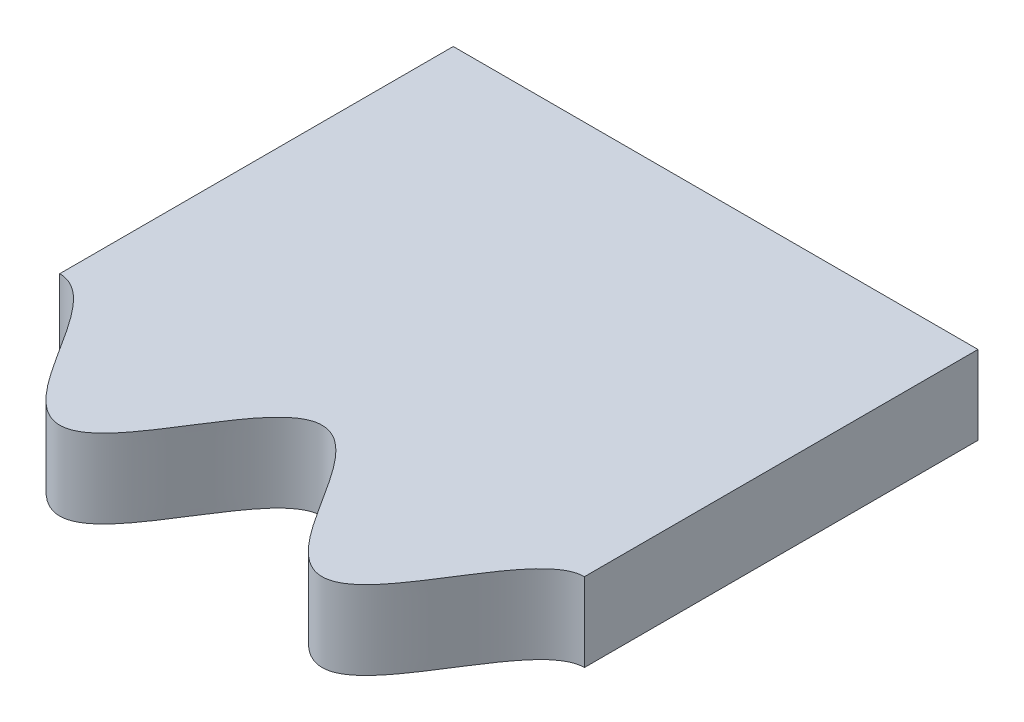
ISO-10303-21;
HEADER;
FILE_DESCRIPTION(('STEP AP214'),'2;1');
FILE_NAME('part.step','',(''),(''),'','','');
FILE_SCHEMA(('AUTOMOTIVE_DESIGN { 1 0 10303 214 1 1 1 1 }'));
ENDSEC;
DATA;
#1=APPLICATION_CONTEXT('core data for automotive mechanical design processes');
#2=APPLICATION_PROTOCOL_DEFINITION('international standard','automotive_design',2000,#1);
#3=PRODUCT_CONTEXT('',#1,'mechanical');
#4=PRODUCT('Part','Part','',(#3));
#5=PRODUCT_RELATED_PRODUCT_CATEGORY('part','',(#4));
#6=PRODUCT_DEFINITION_FORMATION('','',#4);
#7=PRODUCT_DEFINITION_CONTEXT('part definition',#1,'design');
#8=PRODUCT_DEFINITION('design','',#6,#7);
#9=PRODUCT_DEFINITION_SHAPE('','',#8);
#10=(LENGTH_UNIT() NAMED_UNIT(*) SI_UNIT(.MILLI.,.METRE.));
#11=(NAMED_UNIT(*) PLANE_ANGLE_UNIT() SI_UNIT($,.RADIAN.));
#12=(NAMED_UNIT(*) SI_UNIT($,.STERADIAN.) SOLID_ANGLE_UNIT());
#13=UNCERTAINTY_MEASURE_WITH_UNIT(LENGTH_MEASURE(1.E-05),#10,'distance_accuracy_value','');
#14=(GEOMETRIC_REPRESENTATION_CONTEXT(3) GLOBAL_UNCERTAINTY_ASSIGNED_CONTEXT((#13)) GLOBAL_UNIT_ASSIGNED_CONTEXT((#10,
#11,#12)) REPRESENTATION_CONTEXT('',''));
#15=CARTESIAN_POINT('',(0.,0.,0.));
#16=DIRECTION('',(0.,0.,1.));
#17=DIRECTION('',(1.,0.,0.));
#18=AXIS2_PLACEMENT_3D('',#15,#16,#17);
#19=CARTESIAN_POINT('',(10.,3.,10.));
#20=DIRECTION('',(-1.,0.,0.));
#21=DIRECTION('',(0.,0.,1.));
#22=AXIS2_PLACEMENT_3D('',#19,#20,#21);
#23=PLANE('',#22);
#24=DIRECTION('',(0.,1.,0.));
#25=VECTOR('',#24,1.);
#26=CARTESIAN_POINT('',(10.,0.,5.));
#27=LINE('',#26,#25);
#28=CARTESIAN_POINT('',(10.,0.,5.));
#29=VERTEX_POINT('',#28);
#30=CARTESIAN_POINT('',(10.0000000003445,3.,5.));
#31=VERTEX_POINT('',#30);
#32=EDGE_CURVE('E65',#29,#31,#27,.T.);
#33=ORIENTED_EDGE('',*,*,#32,.F.);
#34=DIRECTION('',(0.,0.,-1.));
#35=VECTOR('',#34,1.);
#36=CARTESIAN_POINT('',(10.,0.,10.));
#37=LINE('',#36,#35);
#38=CARTESIAN_POINT('',(10.,0.,-10.));
#39=VERTEX_POINT('',#38);
#40=EDGE_CURVE('E89',#29,#39,#37,.T.);
#41=ORIENTED_EDGE('',*,*,#40,.T.);
#42=DIRECTION('',(0.,-1.,0.));
#43=VECTOR('',#42,1.);
#44=CARTESIAN_POINT('',(10.,3.,-10.));
#45=LINE('',#44,#43);
#46=CARTESIAN_POINT('',(10.,3.,-10.));
#47=VERTEX_POINT('',#46);
#48=EDGE_CURVE('E11',#47,#39,#45,.T.);
#49=ORIENTED_EDGE('',*,*,#48,.F.);
#50=DIRECTION('',(0.,0.,-1.));
#51=VECTOR('',#50,1.);
#52=CARTESIAN_POINT('',(10.,3.,10.));
#53=LINE('',#52,#51);
#54=EDGE_CURVE('E74',#31,#47,#53,.T.);
#55=ORIENTED_EDGE('',*,*,#54,.F.);
#56=EDGE_LOOP('',(#33,#41,#49,#55));
#57=FACE_BOUND('',#56,.T.);
#58=ADVANCED_FACE('F33',(#57),#23,.F.);
#59=CARTESIAN_POINT('',(-10.,3.,10.));
#60=DIRECTION('',(1.,0.,0.));
#61=DIRECTION('',(0.,0.,-1.));
#62=AXIS2_PLACEMENT_3D('',#59,#60,#61);
#63=PLANE('',#62);
#64=DIRECTION('',(0.,1.,0.));
#65=VECTOR('',#64,1.);
#66=CARTESIAN_POINT('',(-10.,0.,5.));
#67=LINE('',#66,#65);
#68=CARTESIAN_POINT('',(-10.,0.,5.));
#69=VERTEX_POINT('',#68);
#70=CARTESIAN_POINT('',(-9.99999999965552,3.,5.));
#71=VERTEX_POINT('',#70);
#72=EDGE_CURVE('E52',#69,#71,#67,.T.);
#73=ORIENTED_EDGE('',*,*,#72,.T.);
#74=DIRECTION('',(0.,0.,1.));
#75=VECTOR('',#74,1.);
#76=CARTESIAN_POINT('',(-10.,3.,10.));
#77=LINE('',#76,#75);
#78=CARTESIAN_POINT('',(-10.,3.,-10.));
#79=VERTEX_POINT('',#78);
#80=EDGE_CURVE('E95',#79,#71,#77,.T.);
#81=ORIENTED_EDGE('',*,*,#80,.F.);
#82=DIRECTION('',(0.,-1.,0.));
#83=VECTOR('',#82,1.);
#84=CARTESIAN_POINT('',(-10.,3.,-10.));
#85=LINE('',#84,#83);
#86=CARTESIAN_POINT('',(-10.,0.,-10.));
#87=VERTEX_POINT('',#86);
#88=EDGE_CURVE('E44',#79,#87,#85,.T.);
#89=ORIENTED_EDGE('',*,*,#88,.T.);
#90=DIRECTION('',(0.,0.,1.));
#91=VECTOR('',#90,1.);
#92=CARTESIAN_POINT('',(-10.,0.,10.));
#93=LINE('',#92,#91);
#94=EDGE_CURVE('E88',#87,#69,#93,.T.);
#95=ORIENTED_EDGE('',*,*,#94,.T.);
#96=EDGE_LOOP('',(#73,#81,#89,#95));
#97=FACE_BOUND('',#96,.T.);
#98=ADVANCED_FACE('F93',(#97),#63,.F.);
#99=CARTESIAN_POINT('',(0.,3.,0.));
#100=DIRECTION('',(0.,-1.,0.));
#101=DIRECTION('',(0.,0.,-1.));
#102=AXIS2_PLACEMENT_3D('',#99,#100,#101);
#103=PLANE('',#102);
#104=CARTESIAN_POINT('',(-9.99999999931104,3.,5.));
#105=CARTESIAN_POINT('',(-9.99082001437918,3.,5.));
#106=CARTESIAN_POINT('',(-9.97244635755843,3.,5.00031258280608));
#107=CARTESIAN_POINT('',(-9.93938747114682,3.,5.0017192065243));
#108=CARTESIAN_POINT('',(-9.89196951877511,3.,5.00545484638884));
#109=CARTESIAN_POINT('',(-9.83592223774,3.,5.01241231200123));
#110=CARTESIAN_POINT('',(-9.77303376701536,3.,5.0243360940524));
#111=CARTESIAN_POINT('',(-9.69889854113709,3.,5.04321948192614));
#112=CARTESIAN_POINT('',(-9.61604277433707,3.,5.07104387662175));
#113=CARTESIAN_POINT('',(-9.51539692492575,3.,5.11282490925097));
#114=CARTESIAN_POINT('',(-9.38733060556712,3.,5.17887883126997));
#115=CARTESIAN_POINT('',(-9.23713055985856,3.,5.27635471018832));
#116=CARTESIAN_POINT('',(-9.06996834134291,3.,5.40982332741547));
#117=CARTESIAN_POINT('',(-8.90457564809527,3.,5.56508434026283));
#118=CARTESIAN_POINT('',(-8.7489612287523,3.,5.73006325874342));
#119=CARTESIAN_POINT('',(-8.60130778536925,3.,5.90213684094534));
#120=CARTESIAN_POINT('',(-8.46007700944654,3.,6.07949551678153));
#121=CARTESIAN_POINT('',(-8.32404000169283,3.,6.26084497150106));
#122=CARTESIAN_POINT('',(-8.18265527581067,3.,6.45853429864135));
#123=CARTESIAN_POINT('',(-8.03590703117052,3.,6.67241814731907));
#124=CARTESIAN_POINT('',(-7.88348141853783,3.,6.90219128809631));
#125=CARTESIAN_POINT('',(-7.72477345486102,3.,7.14737774531498));
#126=CARTESIAN_POINT('',(-7.52835049489709,3.,7.45513225242725));
#127=CARTESIAN_POINT('',(-7.2935706466482,3.,7.8250015959));
#128=CARTESIAN_POINT('',(-7.03464620121291,3.,8.2260611788318));
#129=CARTESIAN_POINT('',(-6.74300148875256,3.,8.65253335255465));
#130=CARTESIAN_POINT('',(-6.45275627161435,3.,9.0386496761071));
#131=CARTESIAN_POINT('',(-6.15977928798915,3.,9.37945193691896));
#132=CARTESIAN_POINT('',(-5.85167297950494,3.,9.66936159789187));
#133=CARTESIAN_POINT('',(-5.52099911676154,3.,9.88951274625956));
#134=CARTESIAN_POINT('',(-5.16718469959597,3.,10.0107796048101));
#135=CARTESIAN_POINT('',(-4.81669827132216,3.,10.0082047149901));
#136=CARTESIAN_POINT('',(-4.46319800184277,3.,9.88148028990629));
#137=CARTESIAN_POINT('',(-4.13245941221351,3.,9.65630351845059));
#138=CARTESIAN_POINT('',(-3.82518617782554,3.,9.36337460129456));
#139=CARTESIAN_POINT('',(-3.53356604995753,3.,9.02140752316623));
#140=CARTESIAN_POINT('',(-3.24460958171085,3.,8.63501856258895));
#141=CARTESIAN_POINT('',(-2.95419813160473,3.,8.20909034918839));
#142=CARTESIAN_POINT('',(-2.65686698526825,3.,7.74795426612715));
#143=CARTESIAN_POINT('',(-2.34581471696202,3.,7.25627199583769));
#144=CARTESIAN_POINT('',(-2.04855364815221,3.,6.79509133401284));
#145=CARTESIAN_POINT('',(-1.75827897641475,3.,6.36907074495268));
#146=CARTESIAN_POINT('',(-1.46954105510516,3.,5.98252143809928));
#147=CARTESIAN_POINT('',(-1.17822395531635,3.,5.64030017025521));
#148=CARTESIAN_POINT('',(-0.871397135841551,3.,5.34692679658111));
#149=CARTESIAN_POINT('',(-0.541242946949233,3.,5.12094954109834));
#150=CARTESIAN_POINT('',(-0.188339321343954,3.,4.99278354485659));
#151=CARTESIAN_POINT('',(0.162127550098853,3.,4.98833930062318));
#152=CARTESIAN_POINT('',(0.516516058955745,3.,5.10812379820319));
#153=CARTESIAN_POINT('',(0.847789499972692,3.,5.32744136166359));
#154=CARTESIAN_POINT('',(1.15633761061201,3.,5.6169010175441));
#155=CARTESIAN_POINT('',(1.44964940090906,3.,5.95742231082353));
#156=CARTESIAN_POINT('',(1.74008086012842,3.,6.34340524055233));
#157=CARTESIAN_POINT('',(2.03192959783582,3.,6.76972875296932));
#158=CARTESIAN_POINT('',(2.40964594109057,3.,7.35487850542105));
#159=CARTESIAN_POINT('',(2.78090922982973,3.,7.94523233006462));
#160=CARTESIAN_POINT('',(3.14574990729865,3.,8.50129399252891));
#161=CARTESIAN_POINT('',(3.52329318896242,3.,9.00864727130667));
#162=CARTESIAN_POINT('',(3.81685925310001,3.,9.35461538527141));
#163=CARTESIAN_POINT('',(4.12602543551394,3.,9.65125911623179));
#164=CARTESIAN_POINT('',(4.4589635091427,3.,9.87955606813572));
#165=CARTESIAN_POINT('',(4.81453515306973,3.,10.0080970607132));
#166=CARTESIAN_POINT('',(5.16651906223438,3.,10.0110153151384));
#167=CARTESIAN_POINT('',(5.52099605302878,3.,9.8895087562826));
#168=CARTESIAN_POINT('',(5.8516752952148,3.,9.6693644201522));
#169=CARTESIAN_POINT('',(6.15977743094213,3.,9.37944993871306));
#170=CARTESIAN_POINT('',(6.45275759757276,3.,9.03865066000419));
#171=CARTESIAN_POINT('',(6.7430002688316,3.,8.65253306261331));
#172=CARTESIAN_POINT('',(7.03464770147423,3.,8.2260608059929));
#173=CARTESIAN_POINT('',(7.33317530977178,3.,7.76365385774044));
#174=CARTESIAN_POINT('',(7.60642338358273,3.,7.3317214480071));
#175=CARTESIAN_POINT('',(7.84311922279969,3.,6.96303763204388));
#176=CARTESIAN_POINT('',(8.03590493109137,3.,6.67241958663214));
#177=CARTESIAN_POINT('',(8.18265718418306,3.,6.45853340349873));
#178=CARTESIAN_POINT('',(8.32403784221397,3.,6.26084548509797));
#179=CARTESIAN_POINT('',(8.46008017960912,3.,6.0794952510917));
#180=CARTESIAN_POINT('',(8.60130281900421,3.,5.90213690838074));
#181=CARTESIAN_POINT('',(8.74896919321557,3.,5.73006337300852));
#182=CARTESIAN_POINT('',(8.90456309324699,3.,5.56508402919109));
#183=CARTESIAN_POINT('',(9.06998641092107,3.,5.40982383276834));
#184=CARTESIAN_POINT('',(9.23710257708555,3.,5.2763538880521));
#185=CARTESIAN_POINT('',(9.40569368871927,3.,5.16699305416285));
#186=CARTESIAN_POINT('',(9.55451652275392,3.,5.09347750486071));
#187=CARTESIAN_POINT('',(9.67766268892188,3.,5.04861308650827));
#188=CARTESIAN_POINT('',(9.7730485325158,3.,5.02433654212541));
#189=CARTESIAN_POINT('',(9.83592168274235,3.,5.01241229509332));
#190=CARTESIAN_POINT('',(9.89196848201379,3.,5.00545481487434));
#191=CARTESIAN_POINT('',(9.93938704672832,3.,5.00171919360456));
#192=CARTESIAN_POINT('',(9.97244631431849,3.,5.00031258145348));
#193=CARTESIAN_POINT('',(9.99082001575711,3.,5.));
#194=CARTESIAN_POINT('',(10.000000000689,3.,5.));
#195=B_SPLINE_CURVE_WITH_KNOTS('',4,(#104,#105,#106,#107,#108,#109,#110,#111,#112,#113,#114,
#115,#116,#117,#118,#119,#120,#121,#122,#123,#124,#125,#126,#127,#128,#129,#130,#131,#132,#133,
#134,#135,#136,#137,#138,#139,#140,#141,#142,#143,#144,#145,#146,#147,#148,#149,#150,#151,#152,
#153,#154,#155,#156,#157,#158,#159,#160,#161,#162,#163,#164,#165,#166,#167,#168,#169,#170,#171,
#172,#173,#174,#175,#176,#177,#178,#179,#180,#181,#182,#183,#184,#185,#186,#187,#188,#189,#190,
#191,#192,#193,#194),.UNSPECIFIED.,.F.,.F.,(5,1,1,1,1,1,1,1,1,1,1,1,1,1,1,1,1,1,1,1,1,1,1,1,1,1,
1,1,1,1,1,1,1,1,1,1,1,1,1,1,1,1,1,1,1,1,1,1,1,1,1,1,1,1,1,1,1,1,1,1,1,1,1,1,1,1,1,1,1,1,1,1,1,1,
1,1,1,1,1,1,1,1,1,1,1,1,1,5),(0.0788154969069754,0.0800698558664366,0.0813242147984401,
0.0825785737304436,0.0838329326624472,0.0863416505264542,0.0888503683904613,0.0913590862544684,
0.0938678041184755,0.0988852398464896,0.105408028363832,0.111930816881175,0.118453605398517,
0.12497639391586,0.131499182433202,0.138021970950545,0.144544759467888,0.15106754798523,
0.159472005704982,0.167876463424733,0.176280921144484,0.184685378864236,0.201494294303738,
0.218303209743241,0.231223727279946,0.24414424481665,0.257064762353355,0.26998527989006,
0.27976852467509,0.28955176946012,0.299506241208716,0.309460712957312,0.322382190403877,
0.335303667850441,0.348225145297005,0.361146622743569,0.377889240891207,0.394631859038846,
0.411374477186485,0.428117095334123,0.441038583364772,0.45396007139542,0.466881559426069,
0.479803047456718,0.489757500982272,0.499711954507825,0.509495207864302,0.519278461220779,
0.532198991532702,0.545119521844626,0.55804005215655,0.570960582468474,0.587769475723957,
0.60457836897944,0.638196155490407,0.65124175130361,0.664287347116814,0.677332942930017,
0.690378538743221,0.700413384641552,0.710448230539883,0.720231475324913,0.730014720109944,
0.742935237646649,0.755855755183354,0.768776272720059,0.781696790256764,0.798505705696267,
0.815314621135769,0.832123536575272,0.840527994295023,0.848932452014775,0.855455240532117,
0.861978029049459,0.868500817566802,0.875023606084144,0.881546394601487,0.888069183118829,
0.894591971636172,0.901114760153514,0.906132195881528,0.911149631609542,0.913658349473549,
0.916167067337556,0.91742142626956,0.918675785201563,0.919930144133567,0.921184503042035),.UNSPECIFIED.);
#196=EDGE_CURVE('E36',#71,#31,#195,.T.);
#197=ORIENTED_EDGE('',*,*,#196,.T.);
#198=ORIENTED_EDGE('',*,*,#54,.T.);
#199=DIRECTION('',(-1.,0.,0.));
#200=VECTOR('',#199,1.);
#201=CARTESIAN_POINT('',(-10.,3.,-10.));
#202=LINE('',#201,#200);
#203=EDGE_CURVE('E99',#47,#79,#202,.T.);
#204=ORIENTED_EDGE('',*,*,#203,.T.);
#205=ORIENTED_EDGE('',*,*,#80,.T.);
#206=EDGE_LOOP('',(#197,#198,#204,#205));
#207=FACE_BOUND('',#206,.T.);
#208=ADVANCED_FACE('F117',(#207),#103,.F.);
#209=CARTESIAN_POINT('',(0.,0.,0.));
#210=DIRECTION('',(0.,-1.,0.));
#211=DIRECTION('',(0.,0.,-1.));
#212=AXIS2_PLACEMENT_3D('',#209,#210,#211);
#213=PLANE('',#212);
#214=ORIENTED_EDGE('',*,*,#40,.F.);
#215=CARTESIAN_POINT('',(-9.99999999931104,0.,5.));
#216=CARTESIAN_POINT('',(-9.99082001437918,0.,5.));
#217=CARTESIAN_POINT('',(-9.97244635755843,0.,5.00031258280608));
#218=CARTESIAN_POINT('',(-9.93938747114682,0.,5.0017192065243));
#219=CARTESIAN_POINT('',(-9.89196951877511,0.,5.00545484638884));
#220=CARTESIAN_POINT('',(-9.83592223774,0.,5.01241231200123));
#221=CARTESIAN_POINT('',(-9.77303376701536,0.,5.0243360940524));
#222=CARTESIAN_POINT('',(-9.69889854113709,0.,5.04321948192614));
#223=CARTESIAN_POINT('',(-9.61604277433707,0.,5.07104387662175));
#224=CARTESIAN_POINT('',(-9.51539692492575,0.,5.11282490925097));
#225=CARTESIAN_POINT('',(-9.38733060556712,0.,5.17887883126997));
#226=CARTESIAN_POINT('',(-9.23713055985856,0.,5.27635471018832));
#227=CARTESIAN_POINT('',(-9.06996834134291,0.,5.40982332741547));
#228=CARTESIAN_POINT('',(-8.90457564809527,0.,5.56508434026283));
#229=CARTESIAN_POINT('',(-8.7489612287523,0.,5.73006325874342));
#230=CARTESIAN_POINT('',(-8.60130778536925,0.,5.90213684094534));
#231=CARTESIAN_POINT('',(-8.46007700944654,0.,6.07949551678153));
#232=CARTESIAN_POINT('',(-8.32404000169283,0.,6.26084497150106));
#233=CARTESIAN_POINT('',(-8.18265527581067,0.,6.45853429864135));
#234=CARTESIAN_POINT('',(-8.03590703117052,0.,6.67241814731907));
#235=CARTESIAN_POINT('',(-7.88348141853783,0.,6.90219128809631));
#236=CARTESIAN_POINT('',(-7.72477345486102,0.,7.14737774531498));
#237=CARTESIAN_POINT('',(-7.52835049489709,0.,7.45513225242725));
#238=CARTESIAN_POINT('',(-7.2935706466482,0.,7.8250015959));
#239=CARTESIAN_POINT('',(-7.03464620121291,0.,8.2260611788318));
#240=CARTESIAN_POINT('',(-6.74300148875256,0.,8.65253335255465));
#241=CARTESIAN_POINT('',(-6.45275627161435,0.,9.0386496761071));
#242=CARTESIAN_POINT('',(-6.15977928798915,0.,9.37945193691896));
#243=CARTESIAN_POINT('',(-5.85167297950494,0.,9.66936159789187));
#244=CARTESIAN_POINT('',(-5.52099911676154,0.,9.88951274625956));
#245=CARTESIAN_POINT('',(-5.16718469959597,0.,10.0107796048101));
#246=CARTESIAN_POINT('',(-4.81669827132216,0.,10.0082047149901));
#247=CARTESIAN_POINT('',(-4.46319800184277,0.,9.88148028990629));
#248=CARTESIAN_POINT('',(-4.13245941221351,0.,9.65630351845059));
#249=CARTESIAN_POINT('',(-3.82518617782554,0.,9.36337460129456));
#250=CARTESIAN_POINT('',(-3.53356604995753,0.,9.02140752316623));
#251=CARTESIAN_POINT('',(-3.24460958171085,0.,8.63501856258895));
#252=CARTESIAN_POINT('',(-2.95419813160473,0.,8.20909034918839));
#253=CARTESIAN_POINT('',(-2.65686698526825,0.,7.74795426612715));
#254=CARTESIAN_POINT('',(-2.34581471696202,0.,7.25627199583769));
#255=CARTESIAN_POINT('',(-2.04855364815221,0.,6.79509133401284));
#256=CARTESIAN_POINT('',(-1.75827897641475,0.,6.36907074495268));
#257=CARTESIAN_POINT('',(-1.46954105510516,0.,5.98252143809928));
#258=CARTESIAN_POINT('',(-1.17822395531635,0.,5.64030017025521));
#259=CARTESIAN_POINT('',(-0.871397135841551,0.,5.34692679658111));
#260=CARTESIAN_POINT('',(-0.541242946949233,0.,5.12094954109834));
#261=CARTESIAN_POINT('',(-0.188339321343954,0.,4.99278354485659));
#262=CARTESIAN_POINT('',(0.162127550098853,0.,4.98833930062318));
#263=CARTESIAN_POINT('',(0.516516058955745,0.,5.10812379820319));
#264=CARTESIAN_POINT('',(0.847789499972692,0.,5.32744136166359));
#265=CARTESIAN_POINT('',(1.15633761061201,0.,5.6169010175441));
#266=CARTESIAN_POINT('',(1.44964940090906,0.,5.95742231082353));
#267=CARTESIAN_POINT('',(1.74008086012842,0.,6.34340524055233));
#268=CARTESIAN_POINT('',(2.03192959783582,0.,6.76972875296932));
#269=CARTESIAN_POINT('',(2.40964594109057,0.,7.35487850542105));
#270=CARTESIAN_POINT('',(2.78090922982973,0.,7.94523233006462));
#271=CARTESIAN_POINT('',(3.14574990729865,0.,8.50129399252891));
#272=CARTESIAN_POINT('',(3.52329318896242,0.,9.00864727130667));
#273=CARTESIAN_POINT('',(3.81685925310001,0.,9.35461538527141));
#274=CARTESIAN_POINT('',(4.12602543551394,0.,9.65125911623179));
#275=CARTESIAN_POINT('',(4.4589635091427,0.,9.87955606813572));
#276=CARTESIAN_POINT('',(4.81453515306973,0.,10.0080970607132));
#277=CARTESIAN_POINT('',(5.16651906223438,0.,10.0110153151384));
#278=CARTESIAN_POINT('',(5.52099605302878,0.,9.8895087562826));
#279=CARTESIAN_POINT('',(5.8516752952148,0.,9.6693644201522));
#280=CARTESIAN_POINT('',(6.15977743094213,0.,9.37944993871306));
#281=CARTESIAN_POINT('',(6.45275759757276,0.,9.03865066000419));
#282=CARTESIAN_POINT('',(6.7430002688316,0.,8.65253306261331));
#283=CARTESIAN_POINT('',(7.03464770147423,0.,8.2260608059929));
#284=CARTESIAN_POINT('',(7.33317530977178,0.,7.76365385774044));
#285=CARTESIAN_POINT('',(7.60642338358273,0.,7.3317214480071));
#286=CARTESIAN_POINT('',(7.84311922279969,0.,6.96303763204388));
#287=CARTESIAN_POINT('',(8.03590493109137,0.,6.67241958663214));
#288=CARTESIAN_POINT('',(8.18265718418306,0.,6.45853340349873));
#289=CARTESIAN_POINT('',(8.32403784221397,0.,6.26084548509797));
#290=CARTESIAN_POINT('',(8.46008017960912,0.,6.0794952510917));
#291=CARTESIAN_POINT('',(8.60130281900421,0.,5.90213690838074));
#292=CARTESIAN_POINT('',(8.74896919321557,0.,5.73006337300852));
#293=CARTESIAN_POINT('',(8.90456309324699,0.,5.56508402919109));
#294=CARTESIAN_POINT('',(9.06998641092107,0.,5.40982383276834));
#295=CARTESIAN_POINT('',(9.23710257708555,0.,5.2763538880521));
#296=CARTESIAN_POINT('',(9.40569368871927,0.,5.16699305416285));
#297=CARTESIAN_POINT('',(9.55451652275392,0.,5.09347750486071));
#298=CARTESIAN_POINT('',(9.67766268892188,0.,5.04861308650827));
#299=CARTESIAN_POINT('',(9.7730485325158,0.,5.02433654212541));
#300=CARTESIAN_POINT('',(9.83592168274235,0.,5.01241229509332));
#301=CARTESIAN_POINT('',(9.89196848201379,0.,5.00545481487434));
#302=CARTESIAN_POINT('',(9.93938704672832,0.,5.00171919360456));
#303=CARTESIAN_POINT('',(9.97244631431849,0.,5.00031258145348));
#304=CARTESIAN_POINT('',(9.99082001575711,0.,5.));
#305=CARTESIAN_POINT('',(10.000000000689,0.,5.));
#306=B_SPLINE_CURVE_WITH_KNOTS('',4,(#215,#216,#217,#218,#219,#220,#221,#222,#223,#224,#225,
#226,#227,#228,#229,#230,#231,#232,#233,#234,#235,#236,#237,#238,#239,#240,#241,#242,#243,#244,
#245,#246,#247,#248,#249,#250,#251,#252,#253,#254,#255,#256,#257,#258,#259,#260,#261,#262,#263,
#264,#265,#266,#267,#268,#269,#270,#271,#272,#273,#274,#275,#276,#277,#278,#279,#280,#281,#282,
#283,#284,#285,#286,#287,#288,#289,#290,#291,#292,#293,#294,#295,#296,#297,#298,#299,#300,#301,
#302,#303,#304,#305),.UNSPECIFIED.,.F.,.F.,(5,1,1,1,1,1,1,1,1,1,1,1,1,1,1,1,1,1,1,1,1,1,1,1,1,1,
1,1,1,1,1,1,1,1,1,1,1,1,1,1,1,1,1,1,1,1,1,1,1,1,1,1,1,1,1,1,1,1,1,1,1,1,1,1,1,1,1,1,1,1,1,1,1,1,
1,1,1,1,1,1,1,1,1,1,1,1,1,5),(0.0788154969069754,0.0800698558664366,0.0813242147984401,
0.0825785737304436,0.0838329326624472,0.0863416505264542,0.0888503683904613,0.0913590862544684,
0.0938678041184755,0.0988852398464896,0.105408028363832,0.111930816881175,0.118453605398517,
0.12497639391586,0.131499182433202,0.138021970950545,0.144544759467888,0.15106754798523,
0.159472005704982,0.167876463424733,0.176280921144484,0.184685378864236,0.201494294303738,
0.218303209743241,0.231223727279946,0.24414424481665,0.257064762353355,0.26998527989006,
0.27976852467509,0.28955176946012,0.299506241208716,0.309460712957312,0.322382190403877,
0.335303667850441,0.348225145297005,0.361146622743569,0.377889240891207,0.394631859038846,
0.411374477186485,0.428117095334123,0.441038583364772,0.45396007139542,0.466881559426069,
0.479803047456718,0.489757500982272,0.499711954507825,0.509495207864302,0.519278461220779,
0.532198991532702,0.545119521844626,0.55804005215655,0.570960582468474,0.587769475723957,
0.60457836897944,0.638196155490407,0.65124175130361,0.664287347116814,0.677332942930017,
0.690378538743221,0.700413384641552,0.710448230539883,0.720231475324913,0.730014720109944,
0.742935237646649,0.755855755183354,0.768776272720059,0.781696790256764,0.798505705696267,
0.815314621135769,0.832123536575272,0.840527994295023,0.848932452014775,0.855455240532117,
0.861978029049459,0.868500817566802,0.875023606084144,0.881546394601487,0.888069183118829,
0.894591971636172,0.901114760153514,0.906132195881528,0.911149631609542,0.913658349473549,
0.916167067337556,0.91742142626956,0.918675785201563,0.919930144133567,0.921184503042035),.UNSPECIFIED.);
#307=EDGE_CURVE('E68',#69,#29,#306,.T.);
#308=ORIENTED_EDGE('',*,*,#307,.F.);
#309=ORIENTED_EDGE('',*,*,#94,.F.);
#310=DIRECTION('',(-1.,0.,0.));
#311=VECTOR('',#310,1.);
#312=CARTESIAN_POINT('',(-10.,0.,-10.));
#313=LINE('',#312,#311);
#314=EDGE_CURVE('E80',#39,#87,#313,.T.);
#315=ORIENTED_EDGE('',*,*,#314,.F.);
#316=EDGE_LOOP('',(#214,#308,#309,#315));
#317=FACE_BOUND('',#316,.T.);
#318=ADVANCED_FACE('F97',(#317),#213,.T.);
#319=CARTESIAN_POINT('',(-10.,3.,-10.));
#320=DIRECTION('',(0.,0.,1.));
#321=DIRECTION('',(1.,0.,0.));
#322=AXIS2_PLACEMENT_3D('',#319,#320,#321);
#323=PLANE('',#322);
#324=ORIENTED_EDGE('',*,*,#314,.T.);
#325=ORIENTED_EDGE('',*,*,#88,.F.);
#326=ORIENTED_EDGE('',*,*,#203,.F.);
#327=ORIENTED_EDGE('',*,*,#48,.T.);
#328=EDGE_LOOP('',(#324,#325,#326,#327));
#329=FACE_BOUND('',#328,.T.);
#330=ADVANCED_FACE('F82',(#329),#323,.F.);
#331=DIRECTION('',(0.,1.,0.));
#332=VECTOR('',#331,1.);
#333=SURFACE_OF_LINEAR_EXTRUSION('',#306,#332);
#334=ORIENTED_EDGE('',*,*,#196,.F.);
#335=ORIENTED_EDGE('',*,*,#72,.F.);
#336=ORIENTED_EDGE('',*,*,#307,.T.);
#337=ORIENTED_EDGE('',*,*,#32,.T.);
#338=EDGE_LOOP('',(#334,#335,#336,#337));
#339=FACE_BOUND('',#338,.T.);
#340=ADVANCED_FACE('F114',(#339),#333,.T.);
#341=CLOSED_SHELL('',(#58,#98,#208,#318,#330,#340));
#342=MANIFOLD_SOLID_BREP('B2',#341);
#343=ADVANCED_BREP_SHAPE_REPRESENTATION('',(#18,#342),#14);
#344=SHAPE_DEFINITION_REPRESENTATION(#9,#343);
ENDSEC;
END-ISO-10303-21;
